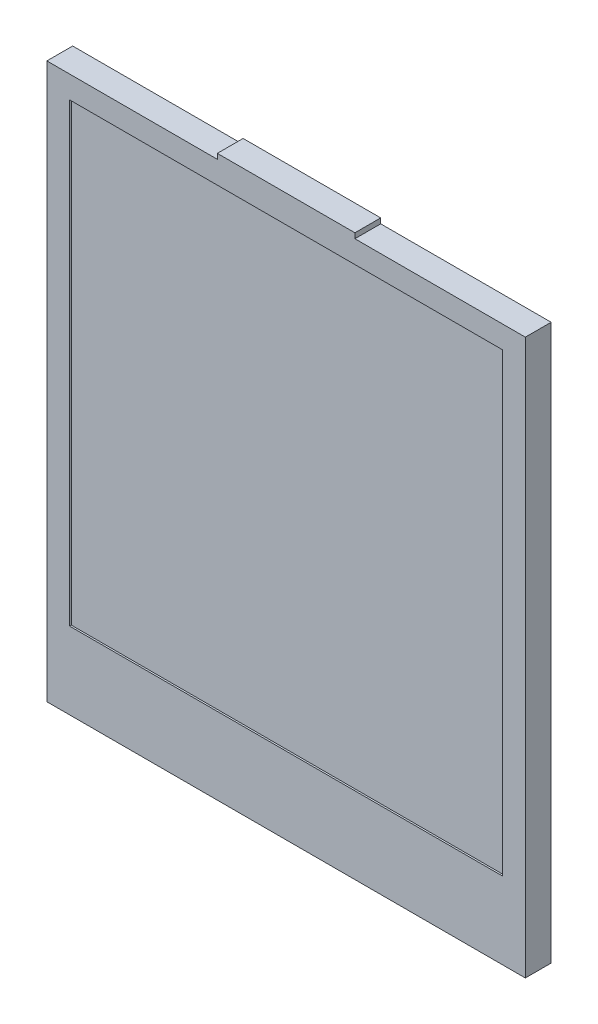
ISO-10303-21;
HEADER;
FILE_DESCRIPTION(('STEP AP214'),'2;1');
FILE_NAME('part.step','',(''),(''),'','','');
FILE_SCHEMA(('AUTOMOTIVE_DESIGN { 1 0 10303 214 1 1 1 1 }'));
ENDSEC;
DATA;
#1=APPLICATION_CONTEXT('core data for automotive mechanical design processes');
#2=APPLICATION_PROTOCOL_DEFINITION('international standard','automotive_design',2000,#1);
#3=PRODUCT_CONTEXT('',#1,'mechanical');
#4=PRODUCT('Part','Part','',(#3));
#5=PRODUCT_RELATED_PRODUCT_CATEGORY('part','',(#4));
#6=PRODUCT_DEFINITION_FORMATION('','',#4);
#7=PRODUCT_DEFINITION_CONTEXT('part definition',#1,'design');
#8=PRODUCT_DEFINITION('design','',#6,#7);
#9=PRODUCT_DEFINITION_SHAPE('','',#8);
#10=(LENGTH_UNIT() NAMED_UNIT(*) SI_UNIT(.MILLI.,.METRE.));
#11=(NAMED_UNIT(*) PLANE_ANGLE_UNIT() SI_UNIT($,.RADIAN.));
#12=(NAMED_UNIT(*) SI_UNIT($,.STERADIAN.) SOLID_ANGLE_UNIT());
#13=UNCERTAINTY_MEASURE_WITH_UNIT(LENGTH_MEASURE(1.E-05),#10,'distance_accuracy_value','');
#14=(GEOMETRIC_REPRESENTATION_CONTEXT(3) GLOBAL_UNCERTAINTY_ASSIGNED_CONTEXT((#13)) GLOBAL_UNIT_ASSIGNED_CONTEXT((#10,
#11,#12)) REPRESENTATION_CONTEXT('',''));
#15=CARTESIAN_POINT('',(0.,0.,0.));
#16=DIRECTION('',(0.,0.,1.));
#17=DIRECTION('',(1.,0.,0.));
#18=AXIS2_PLACEMENT_3D('',#15,#16,#17);
#19=CARTESIAN_POINT('',(-12.585,-13.25,38.0483091264151));
#20=DIRECTION('',(0.,1.,0.));
#21=DIRECTION('',(0.,0.,1.));
#22=AXIS2_PLACEMENT_3D('',#19,#20,#21);
#23=PLANE('',#22);
#24=DIRECTION('',(0.,0.,-1.));
#25=VECTOR('',#24,1.);
#26=CARTESIAN_POINT('',(12.585,-13.25,38.0483091264151));
#27=LINE('',#26,#25);
#28=CARTESIAN_POINT('',(12.585,-13.25,1.4));
#29=VERTEX_POINT('',#28);
#30=CARTESIAN_POINT('',(12.585,-13.25,0.));
#31=VERTEX_POINT('',#30);
#32=EDGE_CURVE('E80',#29,#31,#27,.T.);
#33=ORIENTED_EDGE('',*,*,#32,.F.);
#34=DIRECTION('',(-1.,0.,0.));
#35=VECTOR('',#34,1.);
#36=CARTESIAN_POINT('',(-12.585,-13.25,1.4));
#37=LINE('',#36,#35);
#38=CARTESIAN_POINT('',(-12.585,-13.25,1.4));
#39=VERTEX_POINT('',#38);
#40=EDGE_CURVE('E50',#29,#39,#37,.T.);
#41=ORIENTED_EDGE('',*,*,#40,.T.);
#42=DIRECTION('',(0.,0.,-1.));
#43=VECTOR('',#42,1.);
#44=CARTESIAN_POINT('',(-12.585,-13.25,38.0483091264151));
#45=LINE('',#44,#43);
#46=CARTESIAN_POINT('',(-12.585,-13.25,0.));
#47=VERTEX_POINT('',#46);
#48=EDGE_CURVE('E100',#39,#47,#45,.T.);
#49=ORIENTED_EDGE('',*,*,#48,.T.);
#50=DIRECTION('',(1.,0.,0.));
#51=VECTOR('',#50,1.);
#52=CARTESIAN_POINT('',(-12.585,-13.25,0.));
#53=LINE('',#52,#51);
#54=EDGE_CURVE('E94',#47,#31,#53,.T.);
#55=ORIENTED_EDGE('',*,*,#54,.T.);
#56=EDGE_LOOP('',(#33,#41,#49,#55));
#57=FACE_BOUND('',#56,.T.);
#58=ADVANCED_FACE('F43',(#57),#23,.F.);
#59=CARTESIAN_POINT('',(12.585,-13.25,38.0483091264151));
#60=DIRECTION('',(-1.,0.,0.));
#61=DIRECTION('',(0.,0.,1.));
#62=AXIS2_PLACEMENT_3D('',#59,#60,#61);
#63=PLANE('',#62);
#64=DIRECTION('',(0.,0.,-1.));
#65=VECTOR('',#64,1.);
#66=CARTESIAN_POINT('',(12.585,13.25,38.0483091264151));
#67=LINE('',#66,#65);
#68=CARTESIAN_POINT('',(12.585,13.25,1.4));
#69=VERTEX_POINT('',#68);
#70=CARTESIAN_POINT('',(12.585,13.25,0.));
#71=VERTEX_POINT('',#70);
#72=EDGE_CURVE('E89',#69,#71,#67,.T.);
#73=ORIENTED_EDGE('',*,*,#72,.F.);
#74=DIRECTION('',(0.,-1.,0.));
#75=VECTOR('',#74,1.);
#76=CARTESIAN_POINT('',(12.585,-13.25,1.4));
#77=LINE('',#76,#75);
#78=EDGE_CURVE('E57',#69,#29,#77,.T.);
#79=ORIENTED_EDGE('',*,*,#78,.T.);
#80=ORIENTED_EDGE('',*,*,#32,.T.);
#81=DIRECTION('',(0.,1.,0.));
#82=VECTOR('',#81,1.);
#83=CARTESIAN_POINT('',(12.585,-13.25,0.));
#84=LINE('',#83,#82);
#85=EDGE_CURVE('E84',#31,#71,#84,.T.);
#86=ORIENTED_EDGE('',*,*,#85,.T.);
#87=EDGE_LOOP('',(#73,#79,#80,#86));
#88=FACE_BOUND('',#87,.T.);
#89=ADVANCED_FACE('F83',(#88),#63,.F.);
#90=CARTESIAN_POINT('',(-12.585,13.25,38.0483091264151));
#91=DIRECTION('',(0.,1.,0.));
#92=DIRECTION('',(0.,0.,1.));
#93=AXIS2_PLACEMENT_3D('',#90,#91,#92);
#94=PLANE('',#93);
#95=DIRECTION('',(-1.,0.,0.));
#96=VECTOR('',#95,1.);
#97=CARTESIAN_POINT('',(-12.585,13.25,1.4));
#98=LINE('',#97,#96);
#99=CARTESIAN_POINT('',(-12.585,13.25,1.4));
#100=VERTEX_POINT('',#99);
#101=EDGE_CURVE('E88',#69,#100,#98,.T.);
#102=ORIENTED_EDGE('',*,*,#101,.F.);
#103=ORIENTED_EDGE('',*,*,#72,.T.);
#104=DIRECTION('',(1.,0.,0.));
#105=VECTOR('',#104,1.);
#106=CARTESIAN_POINT('',(-12.585,13.25,0.));
#107=LINE('',#106,#105);
#108=CARTESIAN_POINT('',(-12.585,13.25,0.));
#109=VERTEX_POINT('',#108);
#110=EDGE_CURVE('E97',#109,#71,#107,.T.);
#111=ORIENTED_EDGE('',*,*,#110,.F.);
#112=DIRECTION('',(0.,0.,-1.));
#113=VECTOR('',#112,1.);
#114=CARTESIAN_POINT('',(-12.585,13.25,38.0483091264151));
#115=LINE('',#114,#113);
#116=EDGE_CURVE('E109',#100,#109,#115,.T.);
#117=ORIENTED_EDGE('',*,*,#116,.F.);
#118=EDGE_LOOP('',(#102,#103,#111,#117));
#119=FACE_BOUND('',#118,.T.);
#120=ADVANCED_FACE('F112',(#119),#94,.T.);
#121=CARTESIAN_POINT('',(-12.585,-13.25,38.0483091264151));
#122=DIRECTION('',(-1.,0.,0.));
#123=DIRECTION('',(0.,0.,1.));
#124=AXIS2_PLACEMENT_3D('',#121,#122,#123);
#125=PLANE('',#124);
#126=DIRECTION('',(0.,-1.,0.));
#127=VECTOR('',#126,1.);
#128=CARTESIAN_POINT('',(-12.585,-13.25,1.4));
#129=LINE('',#128,#127);
#130=EDGE_CURVE('E12',#100,#39,#129,.T.);
#131=ORIENTED_EDGE('',*,*,#130,.F.);
#132=ORIENTED_EDGE('',*,*,#116,.T.);
#133=DIRECTION('',(0.,1.,0.));
#134=VECTOR('',#133,1.);
#135=CARTESIAN_POINT('',(-12.585,-13.25,0.));
#136=LINE('',#135,#134);
#137=EDGE_CURVE('E106',#47,#109,#136,.T.);
#138=ORIENTED_EDGE('',*,*,#137,.F.);
#139=ORIENTED_EDGE('',*,*,#48,.F.);
#140=EDGE_LOOP('',(#131,#132,#138,#139));
#141=FACE_BOUND('',#140,.T.);
#142=ADVANCED_FACE('F116',(#141),#125,.T.);
#143=CARTESIAN_POINT('',(0.,0.,0.));
#144=DIRECTION('',(0.,0.,1.));
#145=DIRECTION('',(1.,0.,0.));
#146=AXIS2_PLACEMENT_3D('',#143,#144,#145);
#147=PLANE('',#146);
#148=ORIENTED_EDGE('',*,*,#54,.F.);
#149=ORIENTED_EDGE('',*,*,#137,.T.);
#150=ORIENTED_EDGE('',*,*,#110,.T.);
#151=ORIENTED_EDGE('',*,*,#85,.F.);
#152=EDGE_LOOP('',(#148,#149,#150,#151));
#153=FACE_BOUND('',#152,.T.);
#154=ADVANCED_FACE('F92',(#153),#147,.F.);
#155=CARTESIAN_POINT('',(0.,0.,1.4));
#156=DIRECTION('',(0.,0.,-1.));
#157=DIRECTION('',(-1.,0.,0.));
#158=AXIS2_PLACEMENT_3D('',#155,#156,#157);
#159=PLANE('',#158);
#160=ORIENTED_EDGE('',*,*,#78,.F.);
#161=ORIENTED_EDGE('',*,*,#101,.T.);
#162=ORIENTED_EDGE('',*,*,#130,.T.);
#163=ORIENTED_EDGE('',*,*,#40,.F.);
#164=EDGE_LOOP('',(#160,#161,#162,#163));
#165=FACE_BOUND('',#164,.T.);
#166=ADVANCED_FACE('F123',(#165),#159,.F.);
#167=CLOSED_SHELL('',(#58,#89,#120,#142,#154,#166));
#168=MANIFOLD_SOLID_BREP('B2',#167);
#169=CARTESIAN_POINT('',(0.,0.,1.5));
#170=DIRECTION('',(0.,0.,-1.));
#171=DIRECTION('',(-1.,0.,0.));
#172=AXIS2_PLACEMENT_3D('',#169,#170,#171);
#173=PLANE('',#172);
#174=DIRECTION('',(0.,1.,0.));
#175=VECTOR('',#174,1.);
#176=CARTESIAN_POINT('',(13.91,-17.72,1.5));
#177=LINE('',#176,#175);
#178=CARTESIAN_POINT('',(13.91,-17.72,1.5));
#179=VERTEX_POINT('',#178);
#180=CARTESIAN_POINT('',(13.91,14.55,1.5));
#181=VERTEX_POINT('',#180);
#182=EDGE_CURVE('E292',#179,#181,#177,.T.);
#183=ORIENTED_EDGE('',*,*,#182,.T.);
#184=DIRECTION('',(-1.,0.,0.));
#185=VECTOR('',#184,1.);
#186=CARTESIAN_POINT('',(4.,14.55,1.5));
#187=LINE('',#186,#185);
#188=CARTESIAN_POINT('',(4.,14.55,1.5));
#189=VERTEX_POINT('',#188);
#190=EDGE_CURVE('E295',#181,#189,#187,.T.);
#191=ORIENTED_EDGE('',*,*,#190,.T.);
#192=DIRECTION('',(0.,1.,0.));
#193=VECTOR('',#192,1.);
#194=CARTESIAN_POINT('',(4.,14.85,1.5));
#195=LINE('',#194,#193);
#196=CARTESIAN_POINT('',(4.,14.85,1.5));
#197=VERTEX_POINT('',#196);
#198=EDGE_CURVE('E298',#189,#197,#195,.T.);
#199=ORIENTED_EDGE('',*,*,#198,.T.);
#200=DIRECTION('',(-1.,0.,0.));
#201=VECTOR('',#200,1.);
#202=CARTESIAN_POINT('',(-4.,14.85,1.5));
#203=LINE('',#202,#201);
#204=CARTESIAN_POINT('',(-4.,14.85,1.5));
#205=VERTEX_POINT('',#204);
#206=EDGE_CURVE('E300',#197,#205,#203,.T.);
#207=ORIENTED_EDGE('',*,*,#206,.T.);
#208=DIRECTION('',(0.,-1.,0.));
#209=VECTOR('',#208,1.);
#210=CARTESIAN_POINT('',(-4.,14.85,1.5));
#211=LINE('',#210,#209);
#212=CARTESIAN_POINT('',(-4.,14.55,1.5));
#213=VERTEX_POINT('',#212);
#214=EDGE_CURVE('E302',#205,#213,#211,.T.);
#215=ORIENTED_EDGE('',*,*,#214,.T.);
#216=DIRECTION('',(-1.,0.,0.));
#217=VECTOR('',#216,1.);
#218=CARTESIAN_POINT('',(-13.91,14.55,1.5));
#219=LINE('',#218,#217);
#220=CARTESIAN_POINT('',(-13.91,14.55,1.5));
#221=VERTEX_POINT('',#220);
#222=EDGE_CURVE('E304',#213,#221,#219,.T.);
#223=ORIENTED_EDGE('',*,*,#222,.T.);
#224=DIRECTION('',(0.,-1.,0.));
#225=VECTOR('',#224,1.);
#226=CARTESIAN_POINT('',(-13.91,-17.72,1.5));
#227=LINE('',#226,#225);
#228=CARTESIAN_POINT('',(-13.91,-17.72,1.5));
#229=VERTEX_POINT('',#228);
#230=EDGE_CURVE('E306',#221,#229,#227,.T.);
#231=ORIENTED_EDGE('',*,*,#230,.T.);
#232=DIRECTION('',(1.,0.,0.));
#233=VECTOR('',#232,1.);
#234=CARTESIAN_POINT('',(-13.91,-17.72,1.5));
#235=LINE('',#234,#233);
#236=EDGE_CURVE('E308',#229,#179,#235,.T.);
#237=ORIENTED_EDGE('',*,*,#236,.T.);
#238=EDGE_LOOP('',(#183,#191,#199,#207,#215,#223,#231,#237));
#239=FACE_BOUND('',#238,.T.);
#240=DIRECTION('',(0.,1.,0.));
#241=VECTOR('',#240,1.);
#242=CARTESIAN_POINT('',(12.585,-13.25,1.5));
#243=LINE('',#242,#241);
#244=CARTESIAN_POINT('',(12.585,-13.25,1.5));
#245=VERTEX_POINT('',#244);
#246=CARTESIAN_POINT('',(12.585,13.25,1.5));
#247=VERTEX_POINT('',#246);
#248=EDGE_CURVE('E256',#245,#247,#243,.T.);
#249=ORIENTED_EDGE('',*,*,#248,.F.);
#250=DIRECTION('',(1.,0.,0.));
#251=VECTOR('',#250,1.);
#252=CARTESIAN_POINT('',(-12.585,-13.25,1.5));
#253=LINE('',#252,#251);
#254=CARTESIAN_POINT('',(-12.585,-13.25,1.5));
#255=VERTEX_POINT('',#254);
#256=EDGE_CURVE('E278',#255,#245,#253,.T.);
#257=ORIENTED_EDGE('',*,*,#256,.F.);
#258=DIRECTION('',(0.,-1.,0.));
#259=VECTOR('',#258,1.);
#260=CARTESIAN_POINT('',(-12.585,-13.25,1.5));
#261=LINE('',#260,#259);
#262=CARTESIAN_POINT('',(-12.585,13.25,1.5));
#263=VERTEX_POINT('',#262);
#264=EDGE_CURVE('E276',#263,#255,#261,.T.);
#265=ORIENTED_EDGE('',*,*,#264,.F.);
#266=DIRECTION('',(-1.,0.,0.));
#267=VECTOR('',#266,1.);
#268=CARTESIAN_POINT('',(-12.585,13.25,1.5));
#269=LINE('',#268,#267);
#270=EDGE_CURVE('E264',#247,#263,#269,.T.);
#271=ORIENTED_EDGE('',*,*,#270,.F.);
#272=EDGE_LOOP('',(#249,#257,#265,#271));
#273=FACE_BOUND('',#272,.T.);
#274=ADVANCED_FACE('F167',(#239,#273),#173,.F.);
#275=CARTESIAN_POINT('',(0.,0.,0.));
#276=DIRECTION('',(0.,0.,-1.));
#277=DIRECTION('',(-1.,0.,0.));
#278=AXIS2_PLACEMENT_3D('',#275,#276,#277);
#279=PLANE('',#278);
#280=DIRECTION('',(0.,1.,0.));
#281=VECTOR('',#280,1.);
#282=CARTESIAN_POINT('',(13.91,-17.72,0.));
#283=LINE('',#282,#281);
#284=CARTESIAN_POINT('',(13.91,-17.72,0.));
#285=VERTEX_POINT('',#284);
#286=CARTESIAN_POINT('',(13.91,14.55,0.));
#287=VERTEX_POINT('',#286);
#288=EDGE_CURVE('E272',#285,#287,#283,.T.);
#289=ORIENTED_EDGE('',*,*,#288,.F.);
#290=DIRECTION('',(1.,0.,0.));
#291=VECTOR('',#290,1.);
#292=CARTESIAN_POINT('',(-13.91,-17.72,0.));
#293=LINE('',#292,#291);
#294=CARTESIAN_POINT('',(-13.91,-17.72,0.));
#295=VERTEX_POINT('',#294);
#296=EDGE_CURVE('E296',#295,#285,#293,.T.);
#297=ORIENTED_EDGE('',*,*,#296,.F.);
#298=DIRECTION('',(0.,-1.,0.));
#299=VECTOR('',#298,1.);
#300=CARTESIAN_POINT('',(-13.91,-17.72,0.));
#301=LINE('',#300,#299);
#302=CARTESIAN_POINT('',(-13.91,14.55,0.));
#303=VERTEX_POINT('',#302);
#304=EDGE_CURVE('E323',#303,#295,#301,.T.);
#305=ORIENTED_EDGE('',*,*,#304,.F.);
#306=DIRECTION('',(-1.,0.,0.));
#307=VECTOR('',#306,1.);
#308=CARTESIAN_POINT('',(-13.91,14.55,0.));
#309=LINE('',#308,#307);
#310=CARTESIAN_POINT('',(-4.,14.55,0.));
#311=VERTEX_POINT('',#310);
#312=EDGE_CURVE('E321',#311,#303,#309,.T.);
#313=ORIENTED_EDGE('',*,*,#312,.F.);
#314=DIRECTION('',(0.,-1.,0.));
#315=VECTOR('',#314,1.);
#316=CARTESIAN_POINT('',(-4.,14.85,0.));
#317=LINE('',#316,#315);
#318=CARTESIAN_POINT('',(-4.,14.85,0.));
#319=VERTEX_POINT('',#318);
#320=EDGE_CURVE('E319',#319,#311,#317,.T.);
#321=ORIENTED_EDGE('',*,*,#320,.F.);
#322=DIRECTION('',(-1.,0.,0.));
#323=VECTOR('',#322,1.);
#324=CARTESIAN_POINT('',(-4.,14.85,0.));
#325=LINE('',#324,#323);
#326=CARTESIAN_POINT('',(4.,14.85,0.));
#327=VERTEX_POINT('',#326);
#328=EDGE_CURVE('E317',#327,#319,#325,.T.);
#329=ORIENTED_EDGE('',*,*,#328,.F.);
#330=DIRECTION('',(0.,1.,0.));
#331=VECTOR('',#330,1.);
#332=CARTESIAN_POINT('',(4.,14.85,0.));
#333=LINE('',#332,#331);
#334=CARTESIAN_POINT('',(4.,14.55,0.));
#335=VERTEX_POINT('',#334);
#336=EDGE_CURVE('E315',#335,#327,#333,.T.);
#337=ORIENTED_EDGE('',*,*,#336,.F.);
#338=DIRECTION('',(-1.,0.,0.));
#339=VECTOR('',#338,1.);
#340=CARTESIAN_POINT('',(4.,14.55,0.));
#341=LINE('',#340,#339);
#342=EDGE_CURVE('E313',#287,#335,#341,.T.);
#343=ORIENTED_EDGE('',*,*,#342,.F.);
#344=EDGE_LOOP('',(#289,#297,#305,#313,#321,#329,#337,#343));
#345=FACE_BOUND('',#344,.T.);
#346=DIRECTION('',(1.,0.,0.));
#347=VECTOR('',#346,1.);
#348=CARTESIAN_POINT('',(-12.585,-13.25,0.));
#349=LINE('',#348,#347);
#350=CARTESIAN_POINT('',(-12.585,-13.25,0.));
#351=VERTEX_POINT('',#350);
#352=CARTESIAN_POINT('',(12.585,-13.25,0.));
#353=VERTEX_POINT('',#352);
#354=EDGE_CURVE('E265',#351,#353,#349,.T.);
#355=ORIENTED_EDGE('',*,*,#354,.T.);
#356=DIRECTION('',(0.,1.,0.));
#357=VECTOR('',#356,1.);
#358=CARTESIAN_POINT('',(12.585,-13.25,0.));
#359=LINE('',#358,#357);
#360=CARTESIAN_POINT('',(12.585,13.25,0.));
#361=VERTEX_POINT('',#360);
#362=EDGE_CURVE('E190',#353,#361,#359,.T.);
#363=ORIENTED_EDGE('',*,*,#362,.T.);
#364=DIRECTION('',(-1.,0.,0.));
#365=VECTOR('',#364,1.);
#366=CARTESIAN_POINT('',(-12.585,13.25,0.));
#367=LINE('',#366,#365);
#368=CARTESIAN_POINT('',(-12.585,13.25,0.));
#369=VERTEX_POINT('',#368);
#370=EDGE_CURVE('E271',#361,#369,#367,.T.);
#371=ORIENTED_EDGE('',*,*,#370,.T.);
#372=DIRECTION('',(0.,-1.,0.));
#373=VECTOR('',#372,1.);
#374=CARTESIAN_POINT('',(-12.585,-13.25,0.));
#375=LINE('',#374,#373);
#376=EDGE_CURVE('E284',#369,#351,#375,.T.);
#377=ORIENTED_EDGE('',*,*,#376,.T.);
#378=EDGE_LOOP('',(#355,#363,#371,#377));
#379=FACE_BOUND('',#378,.T.);
#380=ADVANCED_FACE('F353',(#345,#379),#279,.T.);
#381=CARTESIAN_POINT('',(13.91,-17.72,1.5));
#382=DIRECTION('',(-1.,0.,0.));
#383=DIRECTION('',(0.,0.,1.));
#384=AXIS2_PLACEMENT_3D('',#381,#382,#383);
#385=PLANE('',#384);
#386=ORIENTED_EDGE('',*,*,#288,.T.);
#387=DIRECTION('',(0.,0.,-1.));
#388=VECTOR('',#387,1.);
#389=CARTESIAN_POINT('',(13.91,14.55,1.5));
#390=LINE('',#389,#388);
#391=EDGE_CURVE('E41',#181,#287,#390,.T.);
#392=ORIENTED_EDGE('',*,*,#391,.F.);
#393=ORIENTED_EDGE('',*,*,#182,.F.);
#394=DIRECTION('',(0.,0.,-1.));
#395=VECTOR('',#394,1.);
#396=CARTESIAN_POINT('',(13.91,-17.72,1.5));
#397=LINE('',#396,#395);
#398=EDGE_CURVE('E310',#179,#285,#397,.T.);
#399=ORIENTED_EDGE('',*,*,#398,.T.);
#400=EDGE_LOOP('',(#386,#392,#393,#399));
#401=FACE_BOUND('',#400,.T.);
#402=ADVANCED_FACE('F169',(#401),#385,.F.);
#403=CARTESIAN_POINT('',(4.,14.55,1.5));
#404=DIRECTION('',(0.,-1.,0.));
#405=DIRECTION('',(0.,0.,-1.));
#406=AXIS2_PLACEMENT_3D('',#403,#404,#405);
#407=PLANE('',#406);
#408=ORIENTED_EDGE('',*,*,#342,.T.);
#409=DIRECTION('',(0.,0.,-1.));
#410=VECTOR('',#409,1.);
#411=CARTESIAN_POINT('',(4.,14.55,1.5));
#412=LINE('',#411,#410);
#413=EDGE_CURVE('E175',#189,#335,#412,.T.);
#414=ORIENTED_EDGE('',*,*,#413,.F.);
#415=ORIENTED_EDGE('',*,*,#190,.F.);
#416=ORIENTED_EDGE('',*,*,#391,.T.);
#417=EDGE_LOOP('',(#408,#414,#415,#416));
#418=FACE_BOUND('',#417,.T.);
#419=ADVANCED_FACE('F370',(#418),#407,.F.);
#420=CARTESIAN_POINT('',(4.,14.85,1.5));
#421=DIRECTION('',(-1.,0.,0.));
#422=DIRECTION('',(0.,-1.,0.));
#423=AXIS2_PLACEMENT_3D('',#420,#421,#422);
#424=PLANE('',#423);
#425=ORIENTED_EDGE('',*,*,#336,.T.);
#426=DIRECTION('',(0.,0.,-1.));
#427=VECTOR('',#426,1.);
#428=CARTESIAN_POINT('',(4.,14.85,1.5));
#429=LINE('',#428,#427);
#430=EDGE_CURVE('E340',#197,#327,#429,.T.);
#431=ORIENTED_EDGE('',*,*,#430,.F.);
#432=ORIENTED_EDGE('',*,*,#198,.F.);
#433=ORIENTED_EDGE('',*,*,#413,.T.);
#434=EDGE_LOOP('',(#425,#431,#432,#433));
#435=FACE_BOUND('',#434,.T.);
#436=ADVANCED_FACE('F347',(#435),#424,.F.);
#437=CARTESIAN_POINT('',(-4.,14.85,1.5));
#438=DIRECTION('',(0.,-1.,0.));
#439=DIRECTION('',(0.,0.,-1.));
#440=AXIS2_PLACEMENT_3D('',#437,#438,#439);
#441=PLANE('',#440);
#442=ORIENTED_EDGE('',*,*,#328,.T.);
#443=DIRECTION('',(0.,0.,-1.));
#444=VECTOR('',#443,1.);
#445=CARTESIAN_POINT('',(-4.,14.85,1.5));
#446=LINE('',#445,#444);
#447=EDGE_CURVE('E337',#205,#319,#446,.T.);
#448=ORIENTED_EDGE('',*,*,#447,.F.);
#449=ORIENTED_EDGE('',*,*,#206,.F.);
#450=ORIENTED_EDGE('',*,*,#430,.T.);
#451=EDGE_LOOP('',(#442,#448,#449,#450));
#452=FACE_BOUND('',#451,.T.);
#453=ADVANCED_FACE('F359',(#452),#441,.F.);
#454=CARTESIAN_POINT('',(-4.,14.85,1.5));
#455=DIRECTION('',(1.,0.,0.));
#456=DIRECTION('',(0.,1.,0.));
#457=AXIS2_PLACEMENT_3D('',#454,#455,#456);
#458=PLANE('',#457);
#459=ORIENTED_EDGE('',*,*,#320,.T.);
#460=DIRECTION('',(0.,0.,-1.));
#461=VECTOR('',#460,1.);
#462=CARTESIAN_POINT('',(-4.,14.55,1.5));
#463=LINE('',#462,#461);
#464=EDGE_CURVE('E334',#213,#311,#463,.T.);
#465=ORIENTED_EDGE('',*,*,#464,.F.);
#466=ORIENTED_EDGE('',*,*,#214,.F.);
#467=ORIENTED_EDGE('',*,*,#447,.T.);
#468=EDGE_LOOP('',(#459,#465,#466,#467));
#469=FACE_BOUND('',#468,.T.);
#470=ADVANCED_FACE('F363',(#469),#458,.F.);
#471=CARTESIAN_POINT('',(-13.91,14.55,1.5));
#472=DIRECTION('',(0.,-1.,0.));
#473=DIRECTION('',(0.,0.,-1.));
#474=AXIS2_PLACEMENT_3D('',#471,#472,#473);
#475=PLANE('',#474);
#476=ORIENTED_EDGE('',*,*,#312,.T.);
#477=DIRECTION('',(0.,0.,-1.));
#478=VECTOR('',#477,1.);
#479=CARTESIAN_POINT('',(-13.91,14.55,1.5));
#480=LINE('',#479,#478);
#481=EDGE_CURVE('E331',#221,#303,#480,.T.);
#482=ORIENTED_EDGE('',*,*,#481,.F.);
#483=ORIENTED_EDGE('',*,*,#222,.F.);
#484=ORIENTED_EDGE('',*,*,#464,.T.);
#485=EDGE_LOOP('',(#476,#482,#483,#484));
#486=FACE_BOUND('',#485,.T.);
#487=ADVANCED_FACE('F383',(#486),#475,.F.);
#488=CARTESIAN_POINT('',(-13.91,-17.72,1.5));
#489=DIRECTION('',(1.,0.,0.));
#490=DIRECTION('',(0.,0.,-1.));
#491=AXIS2_PLACEMENT_3D('',#488,#489,#490);
#492=PLANE('',#491);
#493=ORIENTED_EDGE('',*,*,#304,.T.);
#494=DIRECTION('',(0.,0.,-1.));
#495=VECTOR('',#494,1.);
#496=CARTESIAN_POINT('',(-13.91,-17.72,1.5));
#497=LINE('',#496,#495);
#498=EDGE_CURVE('E328',#229,#295,#497,.T.);
#499=ORIENTED_EDGE('',*,*,#498,.F.);
#500=ORIENTED_EDGE('',*,*,#230,.F.);
#501=ORIENTED_EDGE('',*,*,#481,.T.);
#502=EDGE_LOOP('',(#493,#499,#500,#501));
#503=FACE_BOUND('',#502,.T.);
#504=ADVANCED_FACE('F381',(#503),#492,.F.);
#505=CARTESIAN_POINT('',(-13.91,-17.72,1.5));
#506=DIRECTION('',(0.,1.,0.));
#507=DIRECTION('',(0.,0.,1.));
#508=AXIS2_PLACEMENT_3D('',#505,#506,#507);
#509=PLANE('',#508);
#510=ORIENTED_EDGE('',*,*,#296,.T.);
#511=ORIENTED_EDGE('',*,*,#398,.F.);
#512=ORIENTED_EDGE('',*,*,#236,.F.);
#513=ORIENTED_EDGE('',*,*,#498,.T.);
#514=EDGE_LOOP('',(#510,#511,#512,#513));
#515=FACE_BOUND('',#514,.T.);
#516=ADVANCED_FACE('F376',(#515),#509,.F.);
#517=CARTESIAN_POINT('',(12.585,-13.25,1.5));
#518=DIRECTION('',(-1.,0.,0.));
#519=DIRECTION('',(0.,0.,1.));
#520=AXIS2_PLACEMENT_3D('',#517,#518,#519);
#521=PLANE('',#520);
#522=ORIENTED_EDGE('',*,*,#362,.F.);
#523=DIRECTION('',(0.,0.,-1.));
#524=VECTOR('',#523,1.);
#525=CARTESIAN_POINT('',(12.585,-13.25,1.5));
#526=LINE('',#525,#524);
#527=EDGE_CURVE('E260',#245,#353,#526,.T.);
#528=ORIENTED_EDGE('',*,*,#527,.F.);
#529=ORIENTED_EDGE('',*,*,#248,.T.);
#530=DIRECTION('',(0.,0.,-1.));
#531=VECTOR('',#530,1.);
#532=CARTESIAN_POINT('',(12.585,13.25,1.5));
#533=LINE('',#532,#531);
#534=EDGE_CURVE('E259',#247,#361,#533,.T.);
#535=ORIENTED_EDGE('',*,*,#534,.T.);
#536=EDGE_LOOP('',(#522,#528,#529,#535));
#537=FACE_BOUND('',#536,.T.);
#538=ADVANCED_FACE('F258',(#537),#521,.T.);
#539=CARTESIAN_POINT('',(-12.585,13.25,1.5));
#540=DIRECTION('',(0.,-1.,0.));
#541=DIRECTION('',(0.,0.,-1.));
#542=AXIS2_PLACEMENT_3D('',#539,#540,#541);
#543=PLANE('',#542);
#544=ORIENTED_EDGE('',*,*,#370,.F.);
#545=ORIENTED_EDGE('',*,*,#534,.F.);
#546=ORIENTED_EDGE('',*,*,#270,.T.);
#547=DIRECTION('',(0.,0.,-1.));
#548=VECTOR('',#547,1.);
#549=CARTESIAN_POINT('',(-12.585,13.25,1.5));
#550=LINE('',#549,#548);
#551=EDGE_CURVE('E273',#263,#369,#550,.T.);
#552=ORIENTED_EDGE('',*,*,#551,.T.);
#553=EDGE_LOOP('',(#544,#545,#546,#552));
#554=FACE_BOUND('',#553,.T.);
#555=ADVANCED_FACE('F268',(#554),#543,.T.);
#556=CARTESIAN_POINT('',(-12.585,-13.25,1.5));
#557=DIRECTION('',(1.,0.,0.));
#558=DIRECTION('',(0.,0.,-1.));
#559=AXIS2_PLACEMENT_3D('',#556,#557,#558);
#560=PLANE('',#559);
#561=ORIENTED_EDGE('',*,*,#376,.F.);
#562=ORIENTED_EDGE('',*,*,#551,.F.);
#563=ORIENTED_EDGE('',*,*,#264,.T.);
#564=DIRECTION('',(0.,0.,-1.));
#565=VECTOR('',#564,1.);
#566=CARTESIAN_POINT('',(-12.585,-13.25,1.5));
#567=LINE('',#566,#565);
#568=EDGE_CURVE('E182',#255,#351,#567,.T.);
#569=ORIENTED_EDGE('',*,*,#568,.T.);
#570=EDGE_LOOP('',(#561,#562,#563,#569));
#571=FACE_BOUND('',#570,.T.);
#572=ADVANCED_FACE('F408',(#571),#560,.T.);
#573=CARTESIAN_POINT('',(-12.585,-13.25,1.5));
#574=DIRECTION('',(0.,1.,0.));
#575=DIRECTION('',(0.,0.,1.));
#576=AXIS2_PLACEMENT_3D('',#573,#574,#575);
#577=PLANE('',#576);
#578=ORIENTED_EDGE('',*,*,#354,.F.);
#579=ORIENTED_EDGE('',*,*,#568,.F.);
#580=ORIENTED_EDGE('',*,*,#256,.T.);
#581=ORIENTED_EDGE('',*,*,#527,.T.);
#582=EDGE_LOOP('',(#578,#579,#580,#581));
#583=FACE_BOUND('',#582,.T.);
#584=ADVANCED_FACE('F412',(#583),#577,.T.);
#585=CLOSED_SHELL('',(#274,#380,#402,#419,#436,#453,#470,#487,#504,#516,#538,#555,#572,#584));
#586=MANIFOLD_SOLID_BREP('B6',#585);
#587=ADVANCED_BREP_SHAPE_REPRESENTATION('',(#18,#168,#586),#14);
#588=SHAPE_DEFINITION_REPRESENTATION(#9,#587);
ENDSEC;
END-ISO-10303-21;
